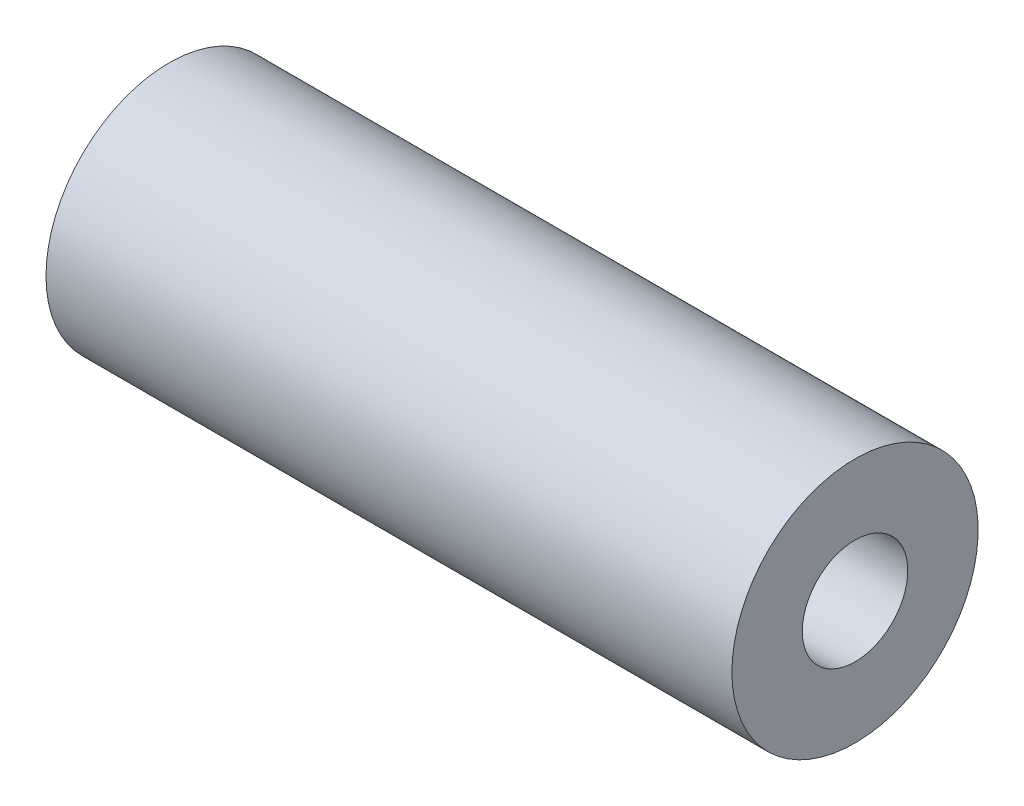
ISO-10303-21;
HEADER;
FILE_DESCRIPTION(('STEP AP214'),'2;1');
FILE_NAME('part.step','',(''),(''),'','','');
FILE_SCHEMA(('AUTOMOTIVE_DESIGN { 1 0 10303 214 1 1 1 1 }'));
ENDSEC;
DATA;
#1=APPLICATION_CONTEXT('core data for automotive mechanical design processes');
#2=APPLICATION_PROTOCOL_DEFINITION('international standard','automotive_design',2000,#1);
#3=PRODUCT_CONTEXT('',#1,'mechanical');
#4=PRODUCT('Part','Part','',(#3));
#5=PRODUCT_RELATED_PRODUCT_CATEGORY('part','',(#4));
#6=PRODUCT_DEFINITION_FORMATION('','',#4);
#7=PRODUCT_DEFINITION_CONTEXT('part definition',#1,'design');
#8=PRODUCT_DEFINITION('design','',#6,#7);
#9=PRODUCT_DEFINITION_SHAPE('','',#8);
#10=(LENGTH_UNIT() NAMED_UNIT(*) SI_UNIT(.MILLI.,.METRE.));
#11=(NAMED_UNIT(*) PLANE_ANGLE_UNIT() SI_UNIT($,.RADIAN.));
#12=(NAMED_UNIT(*) SI_UNIT($,.STERADIAN.) SOLID_ANGLE_UNIT());
#13=UNCERTAINTY_MEASURE_WITH_UNIT(LENGTH_MEASURE(1.E-05),#10,'distance_accuracy_value','');
#14=(GEOMETRIC_REPRESENTATION_CONTEXT(3) GLOBAL_UNCERTAINTY_ASSIGNED_CONTEXT((#13)) GLOBAL_UNIT_ASSIGNED_CONTEXT((#10,
#11,#12)) REPRESENTATION_CONTEXT('',''));
#15=CARTESIAN_POINT('',(0.,0.,0.));
#16=DIRECTION('',(0.,0.,1.));
#17=DIRECTION('',(1.,0.,0.));
#18=AXIS2_PLACEMENT_3D('',#15,#16,#17);
#19=CARTESIAN_POINT('',(-19.5,7.,0.));
#20=DIRECTION('',(1.,0.,0.));
#21=DIRECTION('',(0.,0.,-1.));
#22=AXIS2_PLACEMENT_3D('',#19,#20,#21);
#23=PLANE('',#22);
#24=CARTESIAN_POINT('',(-19.5,0.,0.));
#25=DIRECTION('',(-1.,0.,0.));
#26=DIRECTION('',(0.,0.,1.));
#27=AXIS2_PLACEMENT_3D('',#24,#25,#26);
#28=CIRCLE('',#27,3.);
#29=CARTESIAN_POINT('',(-19.5,0.,3.));
#30=VERTEX_POINT('',#29);
#31=EDGE_CURVE('E10',#30,#30,#28,.T.);
#32=ORIENTED_EDGE('',*,*,#31,.F.);
#33=EDGE_LOOP('',(#32));
#34=FACE_BOUND('',#33,.T.);
#35=CARTESIAN_POINT('',(-19.5,0.,0.));
#36=DIRECTION('',(-1.,0.,0.));
#37=DIRECTION('',(0.,0.,1.));
#38=AXIS2_PLACEMENT_3D('',#35,#36,#37);
#39=CIRCLE('',#38,7.);
#40=CARTESIAN_POINT('',(-19.5,0.,7.));
#41=VERTEX_POINT('',#40);
#42=EDGE_CURVE('E43',#41,#41,#39,.T.);
#43=ORIENTED_EDGE('',*,*,#42,.T.);
#44=EDGE_LOOP('',(#43));
#45=FACE_BOUND('',#44,.T.);
#46=ADVANCED_FACE('F29',(#34,#45),#23,.F.);
#47=CARTESIAN_POINT('',(-37.0031632185857,0.,0.));
#48=DIRECTION('',(-1.,0.,0.));
#49=DIRECTION('',(0.,0.,1.));
#50=AXIS2_PLACEMENT_3D('',#47,#48,#49);
#51=CYLINDRICAL_SURFACE('',#50,3.);
#52=CARTESIAN_POINT('',(19.5,0.,0.));
#53=DIRECTION('',(-1.,0.,0.));
#54=DIRECTION('',(0.,0.,1.));
#55=AXIS2_PLACEMENT_3D('',#52,#53,#54);
#56=CIRCLE('',#55,3.);
#57=CARTESIAN_POINT('',(19.5,0.,3.));
#58=VERTEX_POINT('',#57);
#59=EDGE_CURVE('E35',#58,#58,#56,.T.);
#60=ORIENTED_EDGE('',*,*,#59,.F.);
#61=EDGE_LOOP('',(#60));
#62=FACE_BOUND('',#61,.T.);
#63=ORIENTED_EDGE('',*,*,#31,.T.);
#64=EDGE_LOOP('',(#63));
#65=FACE_BOUND('',#64,.T.);
#66=ADVANCED_FACE('F58',(#62,#65),#51,.F.);
#67=CARTESIAN_POINT('',(19.5,7.,0.));
#68=DIRECTION('',(-1.,0.,0.));
#69=DIRECTION('',(0.,0.,1.));
#70=AXIS2_PLACEMENT_3D('',#67,#68,#69);
#71=PLANE('',#70);
#72=CARTESIAN_POINT('',(19.5,0.,0.));
#73=DIRECTION('',(-1.,0.,0.));
#74=DIRECTION('',(0.,0.,1.));
#75=AXIS2_PLACEMENT_3D('',#72,#73,#74);
#76=CIRCLE('',#75,7.);
#77=CARTESIAN_POINT('',(19.5,0.,7.));
#78=VERTEX_POINT('',#77);
#79=EDGE_CURVE('E39',#78,#78,#76,.T.);
#80=ORIENTED_EDGE('',*,*,#79,.F.);
#81=EDGE_LOOP('',(#80));
#82=FACE_BOUND('',#81,.T.);
#83=ORIENTED_EDGE('',*,*,#59,.T.);
#84=EDGE_LOOP('',(#83));
#85=FACE_BOUND('',#84,.T.);
#86=ADVANCED_FACE('F53',(#82,#85),#71,.F.);
#87=CARTESIAN_POINT('',(-37.0031632185857,0.,0.));
#88=DIRECTION('',(-1.,0.,0.));
#89=DIRECTION('',(0.,0.,1.));
#90=AXIS2_PLACEMENT_3D('',#87,#88,#89);
#91=CYLINDRICAL_SURFACE('',#90,7.);
#92=ORIENTED_EDGE('',*,*,#42,.F.);
#93=EDGE_LOOP('',(#92));
#94=FACE_BOUND('',#93,.T.);
#95=ORIENTED_EDGE('',*,*,#79,.T.);
#96=EDGE_LOOP('',(#95));
#97=FACE_BOUND('',#96,.T.);
#98=ADVANCED_FACE('F50',(#94,#97),#91,.T.);
#99=CLOSED_SHELL('',(#46,#66,#86,#98));
#100=MANIFOLD_SOLID_BREP('B2',#99);
#101=ADVANCED_BREP_SHAPE_REPRESENTATION('',(#18,#100),#14);
#102=SHAPE_DEFINITION_REPRESENTATION(#9,#101);
ENDSEC;
END-ISO-10303-21;
